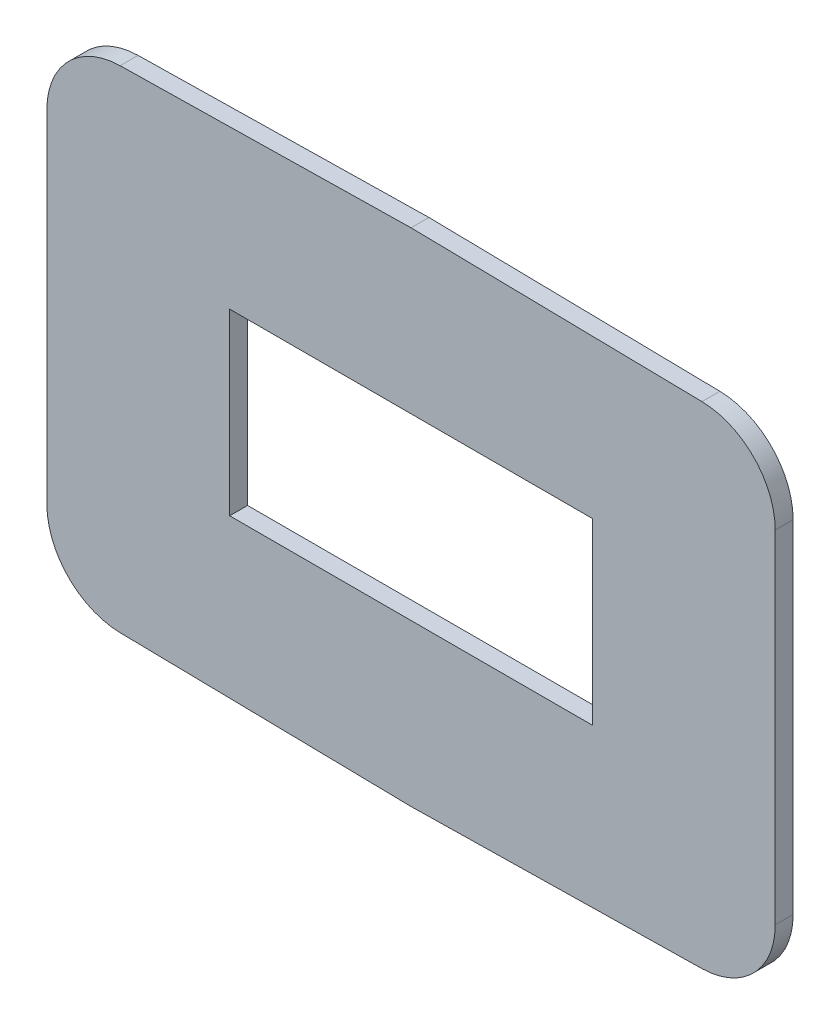
ISO-10303-21;
HEADER;
FILE_DESCRIPTION(('STEP AP214'),'2;1');
FILE_NAME('part.step','',(''),(''),'','','');
FILE_SCHEMA(('AUTOMOTIVE_DESIGN { 1 0 10303 214 1 1 1 1 }'));
ENDSEC;
DATA;
#1=APPLICATION_CONTEXT('core data for automotive mechanical design processes');
#2=APPLICATION_PROTOCOL_DEFINITION('international standard','automotive_design',2000,#1);
#3=PRODUCT_CONTEXT('',#1,'mechanical');
#4=PRODUCT('Part','Part','',(#3));
#5=PRODUCT_RELATED_PRODUCT_CATEGORY('part','',(#4));
#6=PRODUCT_DEFINITION_FORMATION('','',#4);
#7=PRODUCT_DEFINITION_CONTEXT('part definition',#1,'design');
#8=PRODUCT_DEFINITION('design','',#6,#7);
#9=PRODUCT_DEFINITION_SHAPE('','',#8);
#10=(LENGTH_UNIT() NAMED_UNIT(*) SI_UNIT(.MILLI.,.METRE.));
#11=(NAMED_UNIT(*) PLANE_ANGLE_UNIT() SI_UNIT($,.RADIAN.));
#12=(NAMED_UNIT(*) SI_UNIT($,.STERADIAN.) SOLID_ANGLE_UNIT());
#13=UNCERTAINTY_MEASURE_WITH_UNIT(LENGTH_MEASURE(1.E-05),#10,'distance_accuracy_value','');
#14=(GEOMETRIC_REPRESENTATION_CONTEXT(3) GLOBAL_UNCERTAINTY_ASSIGNED_CONTEXT((#13)) GLOBAL_UNIT_ASSIGNED_CONTEXT((#10,
#11,#12)) REPRESENTATION_CONTEXT('',''));
#15=CARTESIAN_POINT('',(0.,0.,0.));
#16=DIRECTION('',(0.,0.,1.));
#17=DIRECTION('',(1.,0.,0.));
#18=AXIS2_PLACEMENT_3D('',#15,#16,#17);
#19=CARTESIAN_POINT('',(3.7096680377933,-15.8766903735083,0.76200000000004));
#20=DIRECTION('',(0.,0.,1.));
#21=DIRECTION('',(1.,0.,0.));
#22=AXIS2_PLACEMENT_3D('',#19,#20,#21);
#23=PLANE('',#22);
#24=DIRECTION('',(0.,-1.00000000000001,0.));
#25=VECTOR('',#24,1.);
#26=CARTESIAN_POINT('',(-27.2958767238953,4.91810582954179,0.762000000000262));
#27=LINE('',#26,#25);
#28=CARTESIAN_POINT('',(-27.2958767238953,1.79804201914945,0.761999999999929));
#29=VERTEX_POINT('',#28);
#30=CARTESIAN_POINT('',(-27.2958767238953,-12.7566265631159,0.762000000000151));
#31=VERTEX_POINT('',#30);
#32=EDGE_CURVE('E190',#29,#31,#27,.T.);
#33=ORIENTED_EDGE('',*,*,#32,.T.);
#34=CARTESIAN_POINT('',(-24.1208767238953,-12.7566265631159,0.762000000000151));
#35=DIRECTION('',(0.,0.,1.));
#36=DIRECTION('',(1.,0.,0.));
#37=AXIS2_PLACEMENT_3D('',#34,#35,#36);
#38=CIRCLE('',#37,3.175);
#39=CARTESIAN_POINT('',(-24.1762881143337,-15.9311429952376,0.76200000000004));
#40=VERTEX_POINT('',#39);
#41=EDGE_CURVE('E237',#31,#40,#38,.T.);
#42=ORIENTED_EDGE('',*,*,#41,.T.);
#43=DIRECTION('',(0.999847695156391,-0.0174524064372873,0.));
#44=VECTOR('',#43,1.);
#45=CARTESIAN_POINT('',(-11.793104343051,-16.1472922719834,0.76200000000004));
#46=LINE('',#45,#44);
#47=CARTESIAN_POINT('',(-11.793104343051,-16.1472922719834,0.76200000000004));
#48=VERTEX_POINT('',#47);
#49=EDGE_CURVE('E193',#40,#48,#46,.T.);
#50=ORIENTED_EDGE('',*,*,#49,.T.);
#51=DIRECTION('',(0.999847695156391,0.0174524064372872,0.));
#52=VECTOR('',#51,1.);
#53=CARTESIAN_POINT('',(-11.793104343051,-16.1472922719834,0.76200000000004));
#54=LINE('',#53,#52);
#55=CARTESIAN_POINT('',(0.590079428231693,-15.9311429952377,0.76200000000004));
#56=VERTEX_POINT('',#55);
#57=EDGE_CURVE('E195',#48,#56,#54,.T.);
#58=ORIENTED_EDGE('',*,*,#57,.T.);
#59=CARTESIAN_POINT('',(0.534668037793284,-12.7566265631159,0.762000000000151));
#60=DIRECTION('',(0.,0.,1.));
#61=DIRECTION('',(1.,0.,0.));
#62=AXIS2_PLACEMENT_3D('',#59,#60,#61);
#63=CIRCLE('',#62,3.175);
#64=CARTESIAN_POINT('',(3.7096680377933,-12.7566265631159,0.762000000000151));
#65=VERTEX_POINT('',#64);
#66=EDGE_CURVE('E233',#56,#65,#63,.T.);
#67=ORIENTED_EDGE('',*,*,#66,.T.);
#68=DIRECTION('',(0.,1.00000000000001,0.));
#69=VECTOR('',#68,1.);
#70=CARTESIAN_POINT('',(3.7096680377933,4.9181058295417,0.762000000000262));
#71=LINE('',#70,#69);
#72=CARTESIAN_POINT('',(3.70966803779329,1.79804201914938,0.761999999999929));
#73=VERTEX_POINT('',#72);
#74=EDGE_CURVE('E182',#65,#73,#71,.T.);
#75=ORIENTED_EDGE('',*,*,#74,.T.);
#76=CARTESIAN_POINT('',(0.534668037793284,1.79804201914945,0.761999999999929));
#77=DIRECTION('',(0.,0.,1.));
#78=DIRECTION('',(1.,0.,0.));
#79=AXIS2_PLACEMENT_3D('',#76,#77,#78);
#80=CIRCLE('',#79,3.175);
#81=CARTESIAN_POINT('',(0.590079428231693,4.97255845127088,0.76200000000004));
#82=VERTEX_POINT('',#81);
#83=EDGE_CURVE('E231',#73,#82,#80,.T.);
#84=ORIENTED_EDGE('',*,*,#83,.T.);
#85=DIRECTION('',(-0.999847695156391,0.0174524064372872,0.));
#86=VECTOR('',#85,1.);
#87=CARTESIAN_POINT('',(3.7096680377933,4.9181058295417,0.762000000000262));
#88=LINE('',#87,#86);
#89=CARTESIAN_POINT('',(-11.793104343051,5.18870772801677,0.761999999999569));
#90=VERTEX_POINT('',#89);
#91=EDGE_CURVE('E185',#82,#90,#88,.T.);
#92=ORIENTED_EDGE('',*,*,#91,.T.);
#93=DIRECTION('',(-0.999847695156391,-0.0174524064372872,0.));
#94=VECTOR('',#93,1.);
#95=CARTESIAN_POINT('',(-27.2958767238953,4.91810582954179,0.762000000000262));
#96=LINE('',#95,#94);
#97=CARTESIAN_POINT('',(-24.1762881143337,4.972558451271,0.76200000000004));
#98=VERTEX_POINT('',#97);
#99=EDGE_CURVE('E188',#90,#98,#96,.T.);
#100=ORIENTED_EDGE('',*,*,#99,.T.);
#101=CARTESIAN_POINT('',(-24.1208767238953,1.79804201914945,0.761999999999929));
#102=DIRECTION('',(0.,0.,1.));
#103=DIRECTION('',(1.,0.,0.));
#104=AXIS2_PLACEMENT_3D('',#101,#102,#103);
#105=CIRCLE('',#104,3.175);
#106=EDGE_CURVE('E235',#98,#29,#105,.T.);
#107=ORIENTED_EDGE('',*,*,#106,.T.);
#108=EDGE_LOOP('',(#33,#42,#50,#58,#67,#75,#84,#92,#100,#107));
#109=FACE_BOUND('',#108,.T.);
#110=DIRECTION('',(-1.,0.,0.));
#111=VECTOR('',#110,1.);
#112=CARTESIAN_POINT('',(-4.07150434305098,-1.66929227198329,0.761999999999569));
#113=LINE('',#112,#111);
#114=CARTESIAN_POINT('',(-4.07150434305098,-1.66929227198329,0.761999999999569));
#115=VERTEX_POINT('',#114);
#116=CARTESIAN_POINT('',(-19.514704343051,-1.66929227198329,0.761999999999569));
#117=VERTEX_POINT('',#116);
#118=EDGE_CURVE('E151',#115,#117,#113,.T.);
#119=ORIENTED_EDGE('',*,*,#118,.F.);
#120=DIRECTION('',(0.,1.00000000000001,0.));
#121=VECTOR('',#120,1.);
#122=CARTESIAN_POINT('',(-4.07150434305098,-1.66929227198329,0.761999999999569));
#123=LINE('',#122,#121);
#124=CARTESIAN_POINT('',(-4.07150434305098,-9.28929227198336,0.76200000000004));
#125=VERTEX_POINT('',#124);
#126=EDGE_CURVE('E141',#125,#115,#123,.T.);
#127=ORIENTED_EDGE('',*,*,#126,.F.);
#128=DIRECTION('',(1.,0.,0.));
#129=VECTOR('',#128,1.);
#130=CARTESIAN_POINT('',(-4.07150434305098,-9.28929227198336,0.76200000000004));
#131=LINE('',#130,#129);
#132=CARTESIAN_POINT('',(-19.514704343051,-9.28929227198336,0.76200000000004));
#133=VERTEX_POINT('',#132);
#134=EDGE_CURVE('E166',#133,#125,#131,.T.);
#135=ORIENTED_EDGE('',*,*,#134,.F.);
#136=DIRECTION('',(0.,-1.00000000000001,0.));
#137=VECTOR('',#136,1.);
#138=CARTESIAN_POINT('',(-19.514704343051,-1.66929227198329,0.761999999999569));
#139=LINE('',#138,#137);
#140=EDGE_CURVE('E164',#117,#133,#139,.T.);
#141=ORIENTED_EDGE('',*,*,#140,.F.);
#142=EDGE_LOOP('',(#119,#127,#135,#141));
#143=FACE_BOUND('',#142,.T.);
#144=ADVANCED_FACE('F36',(#109,#143),#23,.T.);
#145=CARTESIAN_POINT('',(3.7096680377933,-15.8766903735083,-1.38777878078145E-13));
#146=DIRECTION('',(0.,0.,1.));
#147=DIRECTION('',(1.,0.,0.));
#148=AXIS2_PLACEMENT_3D('',#145,#146,#147);
#149=PLANE('',#148);
#150=DIRECTION('',(0.999847695156391,-0.0174524064372873,0.));
#151=VECTOR('',#150,1.);
#152=CARTESIAN_POINT('',(-11.793104343051,-16.1472922719834,2.22044604925031E-13));
#153=LINE('',#152,#151);
#154=CARTESIAN_POINT('',(-24.1762881143337,-15.9311429952375,0.));
#155=VERTEX_POINT('',#154);
#156=CARTESIAN_POINT('',(-11.793104343051,-16.1472922719834,2.22044604925031E-13));
#157=VERTEX_POINT('',#156);
#158=EDGE_CURVE('E207',#155,#157,#153,.T.);
#159=ORIENTED_EDGE('',*,*,#158,.F.);
#160=CARTESIAN_POINT('',(-24.1208767238953,-12.756626563116,1.11022302462516E-13));
#161=DIRECTION('',(0.,0.,1.));
#162=DIRECTION('',(1.,0.,0.));
#163=AXIS2_PLACEMENT_3D('',#160,#161,#162);
#164=CIRCLE('',#163,3.175);
#165=CARTESIAN_POINT('',(-27.2958767238953,-12.756626563116,1.11022302462516E-13));
#166=VERTEX_POINT('',#165);
#167=EDGE_CURVE('E224',#155,#166,#164,.F.);
#168=ORIENTED_EDGE('',*,*,#167,.T.);
#169=DIRECTION('',(0.,-1.00000000000001,0.));
#170=VECTOR('',#169,1.);
#171=CARTESIAN_POINT('',(-27.2958767238953,4.91810582954176,3.33066907387547E-13));
#172=LINE('',#171,#170);
#173=CARTESIAN_POINT('',(-27.2958767238953,1.79804201914934,1.11022302462516E-13));
#174=VERTEX_POINT('',#173);
#175=EDGE_CURVE('E204',#174,#166,#172,.T.);
#176=ORIENTED_EDGE('',*,*,#175,.F.);
#177=CARTESIAN_POINT('',(-24.1208767238953,1.79804201914933,1.11022302462516E-13));
#178=DIRECTION('',(0.,0.,1.));
#179=DIRECTION('',(1.,0.,0.));
#180=AXIS2_PLACEMENT_3D('',#177,#178,#179);
#181=CIRCLE('',#180,3.175);
#182=CARTESIAN_POINT('',(-24.1762881143337,4.97255845127104,3.33066907387547E-13));
#183=VERTEX_POINT('',#182);
#184=EDGE_CURVE('E222',#174,#183,#181,.F.);
#185=ORIENTED_EDGE('',*,*,#184,.T.);
#186=DIRECTION('',(-0.999847695156391,-0.0174524064372872,0.));
#187=VECTOR('',#186,1.);
#188=CARTESIAN_POINT('',(-27.2958767238953,4.91810582954176,3.33066907387547E-13));
#189=LINE('',#188,#187);
#190=CARTESIAN_POINT('',(-11.793104343051,5.18870772801672,0.));
#191=VERTEX_POINT('',#190);
#192=EDGE_CURVE('E202',#191,#183,#189,.T.);
#193=ORIENTED_EDGE('',*,*,#192,.F.);
#194=DIRECTION('',(-0.999847695156391,0.0174524064372872,0.));
#195=VECTOR('',#194,1.);
#196=CARTESIAN_POINT('',(3.7096680377933,4.91810582954165,3.33066907387547E-13));
#197=LINE('',#196,#195);
#198=CARTESIAN_POINT('',(0.590079428231693,4.97255845127104,3.33066907387547E-13));
#199=VERTEX_POINT('',#198);
#200=EDGE_CURVE('E200',#199,#191,#197,.T.);
#201=ORIENTED_EDGE('',*,*,#200,.F.);
#202=CARTESIAN_POINT('',(0.534668037793284,1.79804201914933,1.11022302462516E-13));
#203=DIRECTION('',(0.,0.,1.));
#204=DIRECTION('',(1.,0.,0.));
#205=AXIS2_PLACEMENT_3D('',#202,#203,#204);
#206=CIRCLE('',#205,3.175);
#207=CARTESIAN_POINT('',(3.70966803779329,1.79804201914933,1.11022302462516E-13));
#208=VERTEX_POINT('',#207);
#209=EDGE_CURVE('E218',#199,#208,#206,.F.);
#210=ORIENTED_EDGE('',*,*,#209,.T.);
#211=DIRECTION('',(0.,1.00000000000001,0.));
#212=VECTOR('',#211,1.);
#213=CARTESIAN_POINT('',(3.7096680377933,4.91810582954165,3.33066907387547E-13));
#214=LINE('',#213,#212);
#215=CARTESIAN_POINT('',(3.7096680377933,-12.756626563116,1.11022302462516E-13));
#216=VERTEX_POINT('',#215);
#217=EDGE_CURVE('E159',#216,#208,#214,.T.);
#218=ORIENTED_EDGE('',*,*,#217,.F.);
#219=CARTESIAN_POINT('',(0.534668037793284,-12.756626563116,1.11022302462516E-13));
#220=DIRECTION('',(0.,0.,1.));
#221=DIRECTION('',(1.,0.,0.));
#222=AXIS2_PLACEMENT_3D('',#219,#220,#221);
#223=CIRCLE('',#222,3.175);
#224=CARTESIAN_POINT('',(0.590079428231693,-15.9311429952375,0.));
#225=VERTEX_POINT('',#224);
#226=EDGE_CURVE('E220',#216,#225,#223,.F.);
#227=ORIENTED_EDGE('',*,*,#226,.T.);
#228=DIRECTION('',(0.999847695156391,0.0174524064372872,0.));
#229=VECTOR('',#228,1.);
#230=CARTESIAN_POINT('',(-11.793104343051,-16.1472922719834,2.22044604925031E-13));
#231=LINE('',#230,#229);
#232=EDGE_CURVE('E186',#157,#225,#231,.T.);
#233=ORIENTED_EDGE('',*,*,#232,.F.);
#234=EDGE_LOOP('',(#159,#168,#176,#185,#193,#201,#210,#218,#227,#233));
#235=FACE_BOUND('',#234,.T.);
#236=DIRECTION('',(0.,1.00000000000001,0.));
#237=VECTOR('',#236,1.);
#238=CARTESIAN_POINT('',(-4.07150434305098,-1.66929227198325,-2.22044604925031E-13));
#239=LINE('',#238,#237);
#240=CARTESIAN_POINT('',(-4.07150434305098,-9.28929227198327,0.));
#241=VERTEX_POINT('',#240);
#242=CARTESIAN_POINT('',(-4.07150434305098,-1.66929227198325,-2.22044604925031E-13));
#243=VERTEX_POINT('',#242);
#244=EDGE_CURVE('E170',#241,#243,#239,.T.);
#245=ORIENTED_EDGE('',*,*,#244,.T.);
#246=DIRECTION('',(-1.,0.,0.));
#247=VECTOR('',#246,1.);
#248=CARTESIAN_POINT('',(-4.07150434305098,-1.66929227198325,-2.22044604925031E-13));
#249=LINE('',#248,#247);
#250=CARTESIAN_POINT('',(-19.514704343051,-1.66929227198324,-2.22044604925031E-13));
#251=VERTEX_POINT('',#250);
#252=EDGE_CURVE('E158',#243,#251,#249,.T.);
#253=ORIENTED_EDGE('',*,*,#252,.T.);
#254=DIRECTION('',(0.,-1.00000000000001,0.));
#255=VECTOR('',#254,1.);
#256=CARTESIAN_POINT('',(-19.514704343051,-1.66929227198324,-2.22044604925031E-13));
#257=LINE('',#256,#255);
#258=CARTESIAN_POINT('',(-19.514704343051,-9.28929227198317,0.));
#259=VERTEX_POINT('',#258);
#260=EDGE_CURVE('E173',#251,#259,#257,.T.);
#261=ORIENTED_EDGE('',*,*,#260,.T.);
#262=DIRECTION('',(1.,0.,0.));
#263=VECTOR('',#262,1.);
#264=CARTESIAN_POINT('',(-4.07150434305098,-9.28929227198327,0.));
#265=LINE('',#264,#263);
#266=EDGE_CURVE('E152',#259,#241,#265,.T.);
#267=ORIENTED_EDGE('',*,*,#266,.T.);
#268=EDGE_LOOP('',(#245,#253,#261,#267));
#269=FACE_BOUND('',#268,.T.);
#270=ADVANCED_FACE('F254',(#235,#269),#149,.F.);
#271=CARTESIAN_POINT('',(3.7096680377933,4.9181058295417,0.762000000000262));
#272=DIRECTION('',(-1.,0.,0.));
#273=DIRECTION('',(0.,-1.00000000000001,0.));
#274=AXIS2_PLACEMENT_3D('',#271,#272,#273);
#275=PLANE('',#274);
#276=ORIENTED_EDGE('',*,*,#74,.F.);
#277=DIRECTION('',(0.,0.,-1.));
#278=VECTOR('',#277,1.);
#279=CARTESIAN_POINT('',(3.7096680377933,-12.7566265631159,0.762000000000151));
#280=LINE('',#279,#278);
#281=EDGE_CURVE('E242',#65,#216,#280,.T.);
#282=ORIENTED_EDGE('',*,*,#281,.T.);
#283=ORIENTED_EDGE('',*,*,#217,.T.);
#284=DIRECTION('',(0.,0.,-1.));
#285=VECTOR('',#284,1.);
#286=CARTESIAN_POINT('',(3.70966803779329,1.79804201914938,0.761999999999929));
#287=LINE('',#286,#285);
#288=EDGE_CURVE('E240',#208,#73,#287,.F.);
#289=ORIENTED_EDGE('',*,*,#288,.T.);
#290=EDGE_LOOP('',(#276,#282,#283,#289));
#291=FACE_BOUND('',#290,.T.);
#292=ADVANCED_FACE('F248',(#291),#275,.F.);
#293=CARTESIAN_POINT('',(3.7096680377933,4.9181058295417,0.762000000000262));
#294=DIRECTION('',(-0.0174524064372869,-0.999847695156401,0.));
#295=DIRECTION('',(0.999847695156391,-0.0174524064372872,0.));
#296=AXIS2_PLACEMENT_3D('',#293,#294,#295);
#297=PLANE('',#296);
#298=ORIENTED_EDGE('',*,*,#91,.F.);
#299=DIRECTION('',(0.,0.,-1.));
#300=VECTOR('',#299,1.);
#301=CARTESIAN_POINT('',(0.590079428231693,4.97255845127088,0.76200000000004));
#302=LINE('',#301,#300);
#303=EDGE_CURVE('E11',#82,#199,#302,.T.);
#304=ORIENTED_EDGE('',*,*,#303,.T.);
#305=ORIENTED_EDGE('',*,*,#200,.T.);
#306=DIRECTION('',(0.,0.,-1.));
#307=VECTOR('',#306,1.);
#308=CARTESIAN_POINT('',(-11.793104343051,5.18870772801677,0.761999999999569));
#309=LINE('',#308,#307);
#310=EDGE_CURVE('E212',#90,#191,#309,.T.);
#311=ORIENTED_EDGE('',*,*,#310,.F.);
#312=EDGE_LOOP('',(#298,#304,#305,#311));
#313=FACE_BOUND('',#312,.T.);
#314=ADVANCED_FACE('F264',(#313),#297,.F.);
#315=CARTESIAN_POINT('',(-27.2958767238953,4.91810582954179,0.762000000000262));
#316=DIRECTION('',(0.0174524064372872,-0.999847695156401,0.));
#317=DIRECTION('',(0.999847695156391,0.0174524064372872,0.));
#318=AXIS2_PLACEMENT_3D('',#315,#316,#317);
#319=PLANE('',#318);
#320=ORIENTED_EDGE('',*,*,#192,.T.);
#321=DIRECTION('',(0.,0.,-1.));
#322=VECTOR('',#321,1.);
#323=CARTESIAN_POINT('',(-24.1762881143337,4.972558451271,0.76200000000004));
#324=LINE('',#323,#322);
#325=EDGE_CURVE('E58',#183,#98,#324,.F.);
#326=ORIENTED_EDGE('',*,*,#325,.T.);
#327=ORIENTED_EDGE('',*,*,#99,.F.);
#328=ORIENTED_EDGE('',*,*,#310,.T.);
#329=EDGE_LOOP('',(#320,#326,#327,#328));
#330=FACE_BOUND('',#329,.T.);
#331=ADVANCED_FACE('F297',(#330),#319,.F.);
#332=CARTESIAN_POINT('',(-27.2958767238953,4.91810582954179,0.762000000000262));
#333=DIRECTION('',(1.,0.,0.));
#334=DIRECTION('',(0.,0.,-1.));
#335=AXIS2_PLACEMENT_3D('',#332,#333,#334);
#336=PLANE('',#335);
#337=ORIENTED_EDGE('',*,*,#175,.T.);
#338=DIRECTION('',(0.,0.,-1.));
#339=VECTOR('',#338,1.);
#340=CARTESIAN_POINT('',(-27.2958767238953,-12.7566265631159,0.762000000000151));
#341=LINE('',#340,#339);
#342=EDGE_CURVE('E229',#166,#31,#341,.F.);
#343=ORIENTED_EDGE('',*,*,#342,.T.);
#344=ORIENTED_EDGE('',*,*,#32,.F.);
#345=DIRECTION('',(0.,0.,-1.));
#346=VECTOR('',#345,1.);
#347=CARTESIAN_POINT('',(-27.2958767238953,1.79804201914945,0.761999999999929));
#348=LINE('',#347,#346);
#349=EDGE_CURVE('E226',#29,#174,#348,.T.);
#350=ORIENTED_EDGE('',*,*,#349,.T.);
#351=EDGE_LOOP('',(#337,#343,#344,#350));
#352=FACE_BOUND('',#351,.T.);
#353=ADVANCED_FACE('F293',(#352),#336,.F.);
#354=CARTESIAN_POINT('',(-11.793104343051,-16.1472922719834,0.76200000000004));
#355=DIRECTION('',(0.017452406437287,0.9998476951564,0.));
#356=DIRECTION('',(-0.999847695156391,0.0174524064372873,0.));
#357=AXIS2_PLACEMENT_3D('',#354,#355,#356);
#358=PLANE('',#357);
#359=ORIENTED_EDGE('',*,*,#49,.F.);
#360=DIRECTION('',(0.,0.,-1.));
#361=VECTOR('',#360,1.);
#362=CARTESIAN_POINT('',(-24.1762881143337,-15.9311429952376,0.76200000000004));
#363=LINE('',#362,#361);
#364=EDGE_CURVE('E215',#40,#155,#363,.T.);
#365=ORIENTED_EDGE('',*,*,#364,.T.);
#366=ORIENTED_EDGE('',*,*,#158,.T.);
#367=DIRECTION('',(0.,0.,-1.));
#368=VECTOR('',#367,1.);
#369=CARTESIAN_POINT('',(-11.793104343051,-16.1472922719834,0.76200000000004));
#370=LINE('',#369,#368);
#371=EDGE_CURVE('E197',#48,#157,#370,.T.);
#372=ORIENTED_EDGE('',*,*,#371,.F.);
#373=EDGE_LOOP('',(#359,#365,#366,#372));
#374=FACE_BOUND('',#373,.T.);
#375=ADVANCED_FACE('F290',(#374),#358,.F.);
#376=CARTESIAN_POINT('',(-11.793104343051,-16.1472922719834,0.76200000000004));
#377=DIRECTION('',(-0.0174524064372872,0.999847695156401,0.));
#378=DIRECTION('',(-0.999847695156391,-0.0174524064372872,0.));
#379=AXIS2_PLACEMENT_3D('',#376,#377,#378);
#380=PLANE('',#379);
#381=ORIENTED_EDGE('',*,*,#232,.T.);
#382=DIRECTION('',(0.,0.,-1.));
#383=VECTOR('',#382,1.);
#384=CARTESIAN_POINT('',(0.590079428231693,-15.9311429952377,0.76200000000004));
#385=LINE('',#384,#383);
#386=EDGE_CURVE('E44',#225,#56,#385,.F.);
#387=ORIENTED_EDGE('',*,*,#386,.T.);
#388=ORIENTED_EDGE('',*,*,#57,.F.);
#389=ORIENTED_EDGE('',*,*,#371,.T.);
#390=EDGE_LOOP('',(#381,#387,#388,#389));
#391=FACE_BOUND('',#390,.T.);
#392=ADVANCED_FACE('F287',(#391),#380,.F.);
#393=CARTESIAN_POINT('',(-4.07150434305098,-1.66929227198329,0.761999999999569));
#394=DIRECTION('',(-1.,0.,0.));
#395=DIRECTION('',(0.,-1.00000000000001,0.));
#396=AXIS2_PLACEMENT_3D('',#393,#394,#395);
#397=PLANE('',#396);
#398=ORIENTED_EDGE('',*,*,#244,.F.);
#399=DIRECTION('',(0.,0.,-1.));
#400=VECTOR('',#399,1.);
#401=CARTESIAN_POINT('',(-4.07150434305098,-9.28929227198336,0.76200000000004));
#402=LINE('',#401,#400);
#403=EDGE_CURVE('E147',#125,#241,#402,.T.);
#404=ORIENTED_EDGE('',*,*,#403,.F.);
#405=ORIENTED_EDGE('',*,*,#126,.T.);
#406=DIRECTION('',(0.,0.,-1.));
#407=VECTOR('',#406,1.);
#408=CARTESIAN_POINT('',(-4.07150434305098,-1.66929227198329,0.761999999999569));
#409=LINE('',#408,#407);
#410=EDGE_CURVE('E144',#115,#243,#409,.T.);
#411=ORIENTED_EDGE('',*,*,#410,.T.);
#412=EDGE_LOOP('',(#398,#404,#405,#411));
#413=FACE_BOUND('',#412,.T.);
#414=ADVANCED_FACE('F143',(#413),#397,.T.);
#415=CARTESIAN_POINT('',(-4.07150434305098,-1.66929227198329,0.761999999999569));
#416=DIRECTION('',(0.,-1.00000000000001,0.));
#417=DIRECTION('',(0.,0.,-1.));
#418=AXIS2_PLACEMENT_3D('',#415,#416,#417);
#419=PLANE('',#418);
#420=ORIENTED_EDGE('',*,*,#252,.F.);
#421=ORIENTED_EDGE('',*,*,#410,.F.);
#422=ORIENTED_EDGE('',*,*,#118,.T.);
#423=DIRECTION('',(0.,0.,-1.));
#424=VECTOR('',#423,1.);
#425=CARTESIAN_POINT('',(-19.514704343051,-1.66929227198329,0.761999999999569));
#426=LINE('',#425,#424);
#427=EDGE_CURVE('E160',#117,#251,#426,.T.);
#428=ORIENTED_EDGE('',*,*,#427,.T.);
#429=EDGE_LOOP('',(#420,#421,#422,#428));
#430=FACE_BOUND('',#429,.T.);
#431=ADVANCED_FACE('F155',(#430),#419,.T.);
#432=CARTESIAN_POINT('',(-19.514704343051,-1.66929227198329,0.761999999999569));
#433=DIRECTION('',(1.,0.,0.));
#434=DIRECTION('',(0.,0.,-1.));
#435=AXIS2_PLACEMENT_3D('',#432,#433,#434);
#436=PLANE('',#435);
#437=ORIENTED_EDGE('',*,*,#260,.F.);
#438=ORIENTED_EDGE('',*,*,#427,.F.);
#439=ORIENTED_EDGE('',*,*,#140,.T.);
#440=DIRECTION('',(0.,0.,-1.));
#441=VECTOR('',#440,1.);
#442=CARTESIAN_POINT('',(-19.514704343051,-9.28929227198336,0.76200000000004));
#443=LINE('',#442,#441);
#444=EDGE_CURVE('E179',#133,#259,#443,.T.);
#445=ORIENTED_EDGE('',*,*,#444,.T.);
#446=EDGE_LOOP('',(#437,#438,#439,#445));
#447=FACE_BOUND('',#446,.T.);
#448=ADVANCED_FACE('F311',(#447),#436,.T.);
#449=CARTESIAN_POINT('',(-4.07150434305098,-9.28929227198336,0.76200000000004));
#450=DIRECTION('',(0.,1.00000000000001,0.));
#451=DIRECTION('',(0.,0.,1.));
#452=AXIS2_PLACEMENT_3D('',#449,#450,#451);
#453=PLANE('',#452);
#454=ORIENTED_EDGE('',*,*,#266,.F.);
#455=ORIENTED_EDGE('',*,*,#444,.F.);
#456=ORIENTED_EDGE('',*,*,#134,.T.);
#457=ORIENTED_EDGE('',*,*,#403,.T.);
#458=EDGE_LOOP('',(#454,#455,#456,#457));
#459=FACE_BOUND('',#458,.T.);
#460=ADVANCED_FACE('F306',(#459),#453,.T.);
#461=CARTESIAN_POINT('',(-24.1208767238953,-12.7566265631159,0.762000000000151));
#462=DIRECTION('',(0.,0.,-1.));
#463=DIRECTION('',(-1.,0.,0.));
#464=AXIS2_PLACEMENT_3D('',#461,#462,#463);
#465=CYLINDRICAL_SURFACE('',#464,3.175);
#466=ORIENTED_EDGE('',*,*,#41,.F.);
#467=ORIENTED_EDGE('',*,*,#342,.F.);
#468=ORIENTED_EDGE('',*,*,#167,.F.);
#469=ORIENTED_EDGE('',*,*,#364,.F.);
#470=EDGE_LOOP('',(#466,#467,#468,#469));
#471=FACE_BOUND('',#470,.T.);
#472=ADVANCED_FACE('F275',(#471),#465,.T.);
#473=CARTESIAN_POINT('',(-24.1208767238953,1.79804201914945,0.761999999999929));
#474=DIRECTION('',(0.,0.,-1.));
#475=DIRECTION('',(-1.,0.,0.));
#476=AXIS2_PLACEMENT_3D('',#473,#474,#475);
#477=CYLINDRICAL_SURFACE('',#476,3.175);
#478=ORIENTED_EDGE('',*,*,#106,.F.);
#479=ORIENTED_EDGE('',*,*,#325,.F.);
#480=ORIENTED_EDGE('',*,*,#184,.F.);
#481=ORIENTED_EDGE('',*,*,#349,.F.);
#482=EDGE_LOOP('',(#478,#479,#480,#481));
#483=FACE_BOUND('',#482,.T.);
#484=ADVANCED_FACE('F270',(#483),#477,.T.);
#485=CARTESIAN_POINT('',(0.534668037793284,-12.7566265631159,0.762000000000151));
#486=DIRECTION('',(0.,0.,-1.));
#487=DIRECTION('',(-1.,0.,0.));
#488=AXIS2_PLACEMENT_3D('',#485,#486,#487);
#489=CYLINDRICAL_SURFACE('',#488,3.175);
#490=ORIENTED_EDGE('',*,*,#66,.F.);
#491=ORIENTED_EDGE('',*,*,#386,.F.);
#492=ORIENTED_EDGE('',*,*,#226,.F.);
#493=ORIENTED_EDGE('',*,*,#281,.F.);
#494=EDGE_LOOP('',(#490,#491,#492,#493));
#495=FACE_BOUND('',#494,.T.);
#496=ADVANCED_FACE('F268',(#495),#489,.T.);
#497=CARTESIAN_POINT('',(0.534668037793284,1.79804201914945,0.761999999999929));
#498=DIRECTION('',(0.,0.,-1.));
#499=DIRECTION('',(-1.,0.,0.));
#500=AXIS2_PLACEMENT_3D('',#497,#498,#499);
#501=CYLINDRICAL_SURFACE('',#500,3.175);
#502=ORIENTED_EDGE('',*,*,#83,.F.);
#503=ORIENTED_EDGE('',*,*,#288,.F.);
#504=ORIENTED_EDGE('',*,*,#209,.F.);
#505=ORIENTED_EDGE('',*,*,#303,.F.);
#506=EDGE_LOOP('',(#502,#503,#504,#505));
#507=FACE_BOUND('',#506,.T.);
#508=ADVANCED_FACE('F38',(#507),#501,.T.);
#509=CLOSED_SHELL('',(#144,#270,#292,#314,#331,#353,#375,#392,#414,#431,#448,#460,#472,#484,
#496,#508));
#510=MANIFOLD_SOLID_BREP('B2',#509);
#511=ADVANCED_BREP_SHAPE_REPRESENTATION('',(#18,#510),#14);
#512=SHAPE_DEFINITION_REPRESENTATION(#9,#511);
ENDSEC;
END-ISO-10303-21;
